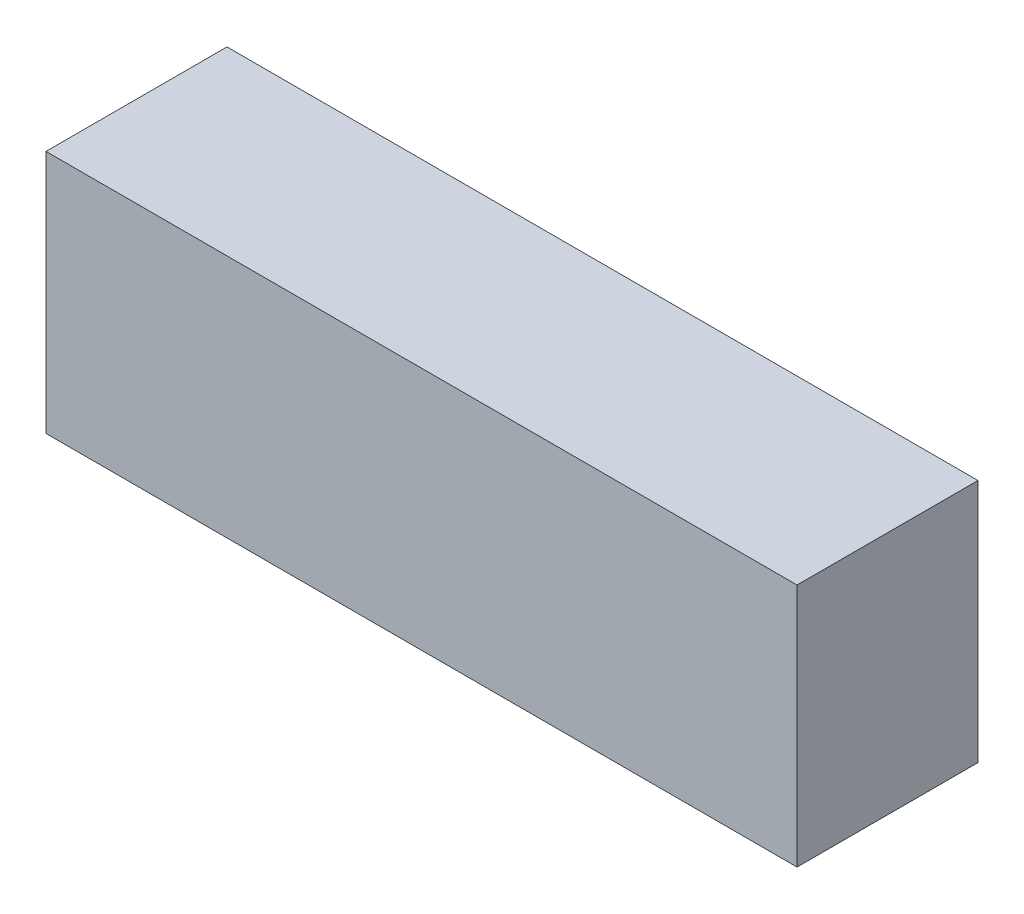
ISO-10303-21;
HEADER;
FILE_DESCRIPTION(('STEP AP214'),'2;1');
FILE_NAME('part.step','',(''),(''),'','','');
FILE_SCHEMA(('AUTOMOTIVE_DESIGN { 1 0 10303 214 1 1 1 1 }'));
ENDSEC;
DATA;
#1=APPLICATION_CONTEXT('core data for automotive mechanical design processes');
#2=APPLICATION_PROTOCOL_DEFINITION('international standard','automotive_design',2000,#1);
#3=PRODUCT_CONTEXT('',#1,'mechanical');
#4=PRODUCT('Part','Part','',(#3));
#5=PRODUCT_RELATED_PRODUCT_CATEGORY('part','',(#4));
#6=PRODUCT_DEFINITION_FORMATION('','',#4);
#7=PRODUCT_DEFINITION_CONTEXT('part definition',#1,'design');
#8=PRODUCT_DEFINITION('design','',#6,#7);
#9=PRODUCT_DEFINITION_SHAPE('','',#8);
#10=(LENGTH_UNIT() NAMED_UNIT(*) SI_UNIT(.MILLI.,.METRE.));
#11=(NAMED_UNIT(*) PLANE_ANGLE_UNIT() SI_UNIT($,.RADIAN.));
#12=(NAMED_UNIT(*) SI_UNIT($,.STERADIAN.) SOLID_ANGLE_UNIT());
#13=UNCERTAINTY_MEASURE_WITH_UNIT(LENGTH_MEASURE(1.E-05),#10,'distance_accuracy_value','');
#14=(GEOMETRIC_REPRESENTATION_CONTEXT(3) GLOBAL_UNCERTAINTY_ASSIGNED_CONTEXT((#13)) GLOBAL_UNIT_ASSIGNED_CONTEXT((#10,
#11,#12)) REPRESENTATION_CONTEXT('',''));
#15=CARTESIAN_POINT('',(0.,0.,0.));
#16=DIRECTION('',(0.,0.,1.));
#17=DIRECTION('',(1.,0.,0.));
#18=AXIS2_PLACEMENT_3D('',#15,#16,#17);
#19=CARTESIAN_POINT('',(0.,5.00000000000402,-17.2));
#20=DIRECTION('',(0.,1.,0.));
#21=DIRECTION('',(1.,0.,0.));
#22=AXIS2_PLACEMENT_3D('',#19,#20,#21);
#23=PLANE('',#22);
#24=DIRECTION('',(-1.,0.,0.));
#25=VECTOR('',#24,1.);
#26=CARTESIAN_POINT('',(4.15,5.00000000000402,-16.2));
#27=LINE('',#26,#25);
#28=CARTESIAN_POINT('',(4.15,5.00000000000402,-16.2));
#29=VERTEX_POINT('',#28);
#30=CARTESIAN_POINT('',(-4.15,5.00000000000402,-16.2));
#31=VERTEX_POINT('',#30);
#32=EDGE_CURVE('E27',#29,#31,#27,.T.);
#33=ORIENTED_EDGE('',*,*,#32,.T.);
#34=DIRECTION('',(0.,0.,-1.));
#35=VECTOR('',#34,1.);
#36=CARTESIAN_POINT('',(-4.15,5.00000000000402,-16.2));
#37=LINE('',#36,#35);
#38=CARTESIAN_POINT('',(-4.15,5.00000000000402,-18.2));
#39=VERTEX_POINT('',#38);
#40=EDGE_CURVE('E80',#31,#39,#37,.T.);
#41=ORIENTED_EDGE('',*,*,#40,.T.);
#42=DIRECTION('',(1.,0.,0.));
#43=VECTOR('',#42,1.);
#44=CARTESIAN_POINT('',(-4.15,5.00000000000402,-18.2));
#45=LINE('',#44,#43);
#46=CARTESIAN_POINT('',(4.15,5.00000000000402,-18.2));
#47=VERTEX_POINT('',#46);
#48=EDGE_CURVE('E102',#39,#47,#45,.T.);
#49=ORIENTED_EDGE('',*,*,#48,.T.);
#50=DIRECTION('',(0.,0.,1.));
#51=VECTOR('',#50,1.);
#52=CARTESIAN_POINT('',(4.15,5.00000000000402,-18.2));
#53=LINE('',#52,#51);
#54=EDGE_CURVE('E81',#47,#29,#53,.T.);
#55=ORIENTED_EDGE('',*,*,#54,.T.);
#56=EDGE_LOOP('',(#33,#41,#49,#55));
#57=FACE_BOUND('',#56,.T.);
#58=ADVANCED_FACE('F17',(#57),#23,.F.);
#59=CARTESIAN_POINT('',(0.,7.70000000000402,-17.2));
#60=DIRECTION('',(0.,1.,0.));
#61=DIRECTION('',(1.,0.,0.));
#62=AXIS2_PLACEMENT_3D('',#59,#60,#61);
#63=PLANE('',#62);
#64=DIRECTION('',(1.,0.,0.));
#65=VECTOR('',#64,1.);
#66=CARTESIAN_POINT('',(4.15,7.70000000000402,-16.2));
#67=LINE('',#66,#65);
#68=CARTESIAN_POINT('',(-4.15,7.70000000000402,-16.2));
#69=VERTEX_POINT('',#68);
#70=CARTESIAN_POINT('',(4.15,7.70000000000402,-16.2));
#71=VERTEX_POINT('',#70);
#72=EDGE_CURVE('E11',#69,#71,#67,.T.);
#73=ORIENTED_EDGE('',*,*,#72,.T.);
#74=DIRECTION('',(0.,0.,-1.));
#75=VECTOR('',#74,1.);
#76=CARTESIAN_POINT('',(4.15,7.70000000000402,-18.2));
#77=LINE('',#76,#75);
#78=CARTESIAN_POINT('',(4.15,7.70000000000402,-18.2));
#79=VERTEX_POINT('',#78);
#80=EDGE_CURVE('E101',#71,#79,#77,.T.);
#81=ORIENTED_EDGE('',*,*,#80,.T.);
#82=DIRECTION('',(-1.,0.,0.));
#83=VECTOR('',#82,1.);
#84=CARTESIAN_POINT('',(-4.15,7.70000000000402,-18.2));
#85=LINE('',#84,#83);
#86=CARTESIAN_POINT('',(-4.15,7.70000000000402,-18.2));
#87=VERTEX_POINT('',#86);
#88=EDGE_CURVE('E67',#79,#87,#85,.T.);
#89=ORIENTED_EDGE('',*,*,#88,.T.);
#90=DIRECTION('',(0.,0.,1.));
#91=VECTOR('',#90,1.);
#92=CARTESIAN_POINT('',(-4.15,7.70000000000402,-16.2));
#93=LINE('',#92,#91);
#94=EDGE_CURVE('E89',#87,#69,#93,.T.);
#95=ORIENTED_EDGE('',*,*,#94,.T.);
#96=EDGE_LOOP('',(#73,#81,#89,#95));
#97=FACE_BOUND('',#96,.T.);
#98=ADVANCED_FACE('F167',(#97),#63,.T.);
#99=CARTESIAN_POINT('',(-4.15,5.00000000000402,-16.2));
#100=DIRECTION('',(0.,0.,1.));
#101=DIRECTION('',(1.,0.,0.));
#102=AXIS2_PLACEMENT_3D('',#99,#100,#101);
#103=PLANE('',#102);
#104=ORIENTED_EDGE('',*,*,#32,.F.);
#105=DIRECTION('',(0.,1.,0.));
#106=VECTOR('',#105,1.);
#107=CARTESIAN_POINT('',(4.15,5.00000000000402,-16.2));
#108=LINE('',#107,#106);
#109=EDGE_CURVE('E83',#29,#71,#108,.T.);
#110=ORIENTED_EDGE('',*,*,#109,.T.);
#111=ORIENTED_EDGE('',*,*,#72,.F.);
#112=DIRECTION('',(0.,1.,0.));
#113=VECTOR('',#112,1.);
#114=CARTESIAN_POINT('',(-4.15,5.00000000000402,-16.2));
#115=LINE('',#114,#113);
#116=EDGE_CURVE('E85',#31,#69,#115,.T.);
#117=ORIENTED_EDGE('',*,*,#116,.F.);
#118=EDGE_LOOP('',(#104,#110,#111,#117));
#119=FACE_BOUND('',#118,.T.);
#120=ADVANCED_FACE('F19',(#119),#103,.T.);
#121=CARTESIAN_POINT('',(4.15,5.00000000000402,-16.2));
#122=DIRECTION('',(1.,0.,0.));
#123=DIRECTION('',(0.,0.,-1.));
#124=AXIS2_PLACEMENT_3D('',#121,#122,#123);
#125=PLANE('',#124);
#126=ORIENTED_EDGE('',*,*,#54,.F.);
#127=DIRECTION('',(0.,1.,0.));
#128=VECTOR('',#127,1.);
#129=CARTESIAN_POINT('',(4.15,5.00000000000402,-18.2));
#130=LINE('',#129,#128);
#131=EDGE_CURVE('E109',#47,#79,#130,.T.);
#132=ORIENTED_EDGE('',*,*,#131,.T.);
#133=ORIENTED_EDGE('',*,*,#80,.F.);
#134=ORIENTED_EDGE('',*,*,#109,.F.);
#135=EDGE_LOOP('',(#126,#132,#133,#134));
#136=FACE_BOUND('',#135,.T.);
#137=ADVANCED_FACE('F170',(#136),#125,.T.);
#138=CARTESIAN_POINT('',(4.15,5.00000000000402,-18.2));
#139=DIRECTION('',(0.,0.,-1.));
#140=DIRECTION('',(0.,-1.,0.));
#141=AXIS2_PLACEMENT_3D('',#138,#139,#140);
#142=PLANE('',#141);
#143=ORIENTED_EDGE('',*,*,#48,.F.);
#144=DIRECTION('',(0.,1.,0.));
#145=VECTOR('',#144,1.);
#146=CARTESIAN_POINT('',(-4.15,5.00000000000402,-18.2));
#147=LINE('',#146,#145);
#148=EDGE_CURVE('E21',#39,#87,#147,.T.);
#149=ORIENTED_EDGE('',*,*,#148,.T.);
#150=ORIENTED_EDGE('',*,*,#88,.F.);
#151=ORIENTED_EDGE('',*,*,#131,.F.);
#152=EDGE_LOOP('',(#143,#149,#150,#151));
#153=FACE_BOUND('',#152,.T.);
#154=ADVANCED_FACE('F172',(#153),#142,.T.);
#155=CARTESIAN_POINT('',(-4.15,5.00000000000402,-18.2));
#156=DIRECTION('',(-1.,0.,0.));
#157=DIRECTION('',(0.,1.,0.));
#158=AXIS2_PLACEMENT_3D('',#155,#156,#157);
#159=PLANE('',#158);
#160=ORIENTED_EDGE('',*,*,#40,.F.);
#161=ORIENTED_EDGE('',*,*,#116,.T.);
#162=ORIENTED_EDGE('',*,*,#94,.F.);
#163=ORIENTED_EDGE('',*,*,#148,.F.);
#164=EDGE_LOOP('',(#160,#161,#162,#163));
#165=FACE_BOUND('',#164,.T.);
#166=ADVANCED_FACE('F92',(#165),#159,.T.);
#167=CLOSED_SHELL('',(#58,#98,#120,#137,#154,#166));
#168=MANIFOLD_SOLID_BREP('B1',#167);
#169=ADVANCED_BREP_SHAPE_REPRESENTATION('',(#18,#168),#14);
#170=SHAPE_DEFINITION_REPRESENTATION(#9,#169);
ENDSEC;
END-ISO-10303-21;
